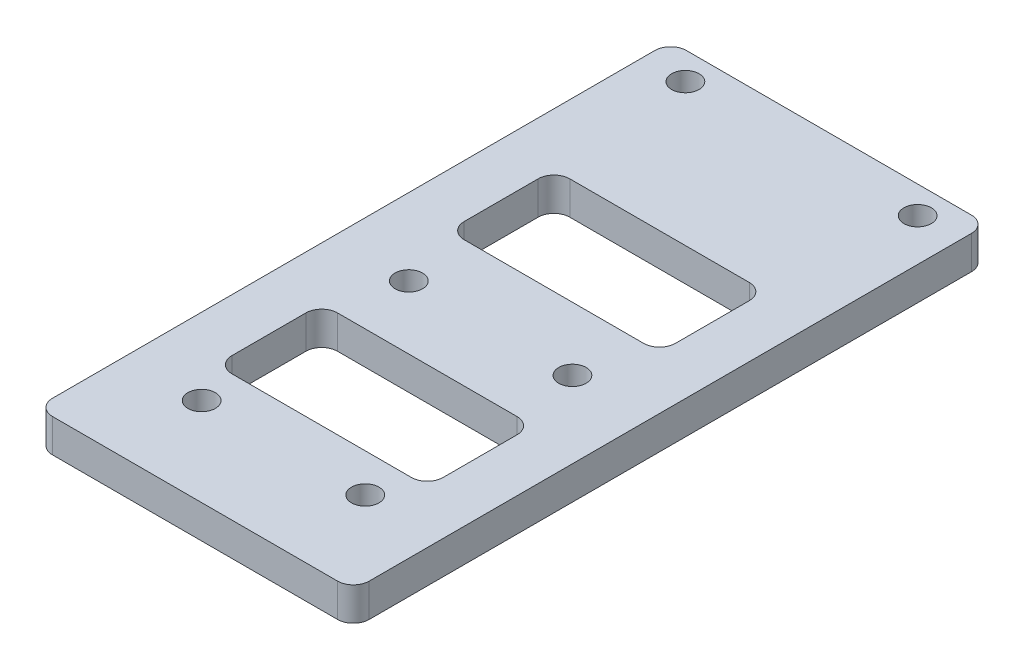
ISO-10303-21;
HEADER;
FILE_DESCRIPTION(('STEP AP214'),'2;1');
FILE_NAME('part.step','',(''),(''),'','','');
FILE_SCHEMA(('AUTOMOTIVE_DESIGN { 1 0 10303 214 1 1 1 1 }'));
ENDSEC;
DATA;
#1=APPLICATION_CONTEXT('core data for automotive mechanical design processes');
#2=APPLICATION_PROTOCOL_DEFINITION('international standard','automotive_design',2000,#1);
#3=PRODUCT_CONTEXT('',#1,'mechanical');
#4=PRODUCT('Part','Part','',(#3));
#5=PRODUCT_RELATED_PRODUCT_CATEGORY('part','',(#4));
#6=PRODUCT_DEFINITION_FORMATION('','',#4);
#7=PRODUCT_DEFINITION_CONTEXT('part definition',#1,'design');
#8=PRODUCT_DEFINITION('design','',#6,#7);
#9=PRODUCT_DEFINITION_SHAPE('','',#8);
#10=(LENGTH_UNIT() NAMED_UNIT(*) SI_UNIT(.MILLI.,.METRE.));
#11=(NAMED_UNIT(*) PLANE_ANGLE_UNIT() SI_UNIT($,.RADIAN.));
#12=(NAMED_UNIT(*) SI_UNIT($,.STERADIAN.) SOLID_ANGLE_UNIT());
#13=UNCERTAINTY_MEASURE_WITH_UNIT(LENGTH_MEASURE(1.E-05),#10,'distance_accuracy_value','');
#14=(GEOMETRIC_REPRESENTATION_CONTEXT(3) GLOBAL_UNCERTAINTY_ASSIGNED_CONTEXT((#13)) GLOBAL_UNIT_ASSIGNED_CONTEXT((#10,
#11,#12)) REPRESENTATION_CONTEXT('',''));
#15=CARTESIAN_POINT('',(0.,0.,0.));
#16=DIRECTION('',(0.,0.,1.));
#17=DIRECTION('',(1.,0.,0.));
#18=AXIS2_PLACEMENT_3D('',#15,#16,#17);
#19=CARTESIAN_POINT('',(-15.,-3.15,-30.025));
#20=DIRECTION('',(-1.,0.,0.));
#21=DIRECTION('',(0.,0.,1.));
#22=AXIS2_PLACEMENT_3D('',#19,#20,#21);
#23=PLANE('',#22);
#24=DIRECTION('',(0.,0.,1.));
#25=VECTOR('',#24,1.);
#26=CARTESIAN_POINT('',(-15.,-3.15,-30.025));
#27=LINE('',#26,#25);
#28=CARTESIAN_POINT('',(-15.,-3.15,-28.525));
#29=VERTEX_POINT('',#28);
#30=CARTESIAN_POINT('',(-15.,-3.15,28.525));
#31=VERTEX_POINT('',#30);
#32=EDGE_CURVE('E343',#29,#31,#27,.T.);
#33=ORIENTED_EDGE('',*,*,#32,.T.);
#34=DIRECTION('',(0.,1.,0.));
#35=VECTOR('',#34,1.);
#36=CARTESIAN_POINT('',(-15.,-3.15,28.525));
#37=LINE('',#36,#35);
#38=CARTESIAN_POINT('',(-15.,0.,28.525));
#39=VERTEX_POINT('',#38);
#40=EDGE_CURVE('E392',#31,#39,#37,.T.);
#41=ORIENTED_EDGE('',*,*,#40,.T.);
#42=DIRECTION('',(0.,0.,1.));
#43=VECTOR('',#42,1.);
#44=CARTESIAN_POINT('',(-15.,0.,-30.025));
#45=LINE('',#44,#43);
#46=CARTESIAN_POINT('',(-15.,0.,-28.525));
#47=VERTEX_POINT('',#46);
#48=EDGE_CURVE('E267',#47,#39,#45,.T.);
#49=ORIENTED_EDGE('',*,*,#48,.F.);
#50=DIRECTION('',(0.,1.,0.));
#51=VECTOR('',#50,1.);
#52=CARTESIAN_POINT('',(-15.,-3.15,-28.525));
#53=LINE('',#52,#51);
#54=EDGE_CURVE('E390',#47,#29,#53,.F.);
#55=ORIENTED_EDGE('',*,*,#54,.T.);
#56=EDGE_LOOP('',(#33,#41,#49,#55));
#57=FACE_BOUND('',#56,.T.);
#58=ADVANCED_FACE('F38',(#57),#23,.T.);
#59=CARTESIAN_POINT('',(-15.,-3.15,-30.025));
#60=DIRECTION('',(0.,0.,-1.));
#61=DIRECTION('',(-1.,0.,0.));
#62=AXIS2_PLACEMENT_3D('',#59,#60,#61);
#63=PLANE('',#62);
#64=DIRECTION('',(-1.,0.,0.));
#65=VECTOR('',#64,1.);
#66=CARTESIAN_POINT('',(-15.,0.,-30.025));
#67=LINE('',#66,#65);
#68=CARTESIAN_POINT('',(13.5,0.,-30.025));
#69=VERTEX_POINT('',#68);
#70=CARTESIAN_POINT('',(-13.5,0.,-30.025));
#71=VERTEX_POINT('',#70);
#72=EDGE_CURVE('E347',#69,#71,#67,.T.);
#73=ORIENTED_EDGE('',*,*,#72,.F.);
#74=DIRECTION('',(0.,1.,0.));
#75=VECTOR('',#74,1.);
#76=CARTESIAN_POINT('',(13.5,-3.15,-30.025));
#77=LINE('',#76,#75);
#78=CARTESIAN_POINT('',(13.5,-3.15,-30.025));
#79=VERTEX_POINT('',#78);
#80=EDGE_CURVE('E11',#69,#79,#77,.F.);
#81=ORIENTED_EDGE('',*,*,#80,.T.);
#82=DIRECTION('',(-1.,0.,0.));
#83=VECTOR('',#82,1.);
#84=CARTESIAN_POINT('',(-15.,-3.15,-30.025));
#85=LINE('',#84,#83);
#86=CARTESIAN_POINT('',(-13.5,-3.15,-30.025));
#87=VERTEX_POINT('',#86);
#88=EDGE_CURVE('E353',#79,#87,#85,.T.);
#89=ORIENTED_EDGE('',*,*,#88,.T.);
#90=DIRECTION('',(0.,1.,0.));
#91=VECTOR('',#90,1.);
#92=CARTESIAN_POINT('',(-13.5,-3.15,-30.025));
#93=LINE('',#92,#91);
#94=EDGE_CURVE('E46',#87,#71,#93,.T.);
#95=ORIENTED_EDGE('',*,*,#94,.T.);
#96=EDGE_LOOP('',(#73,#81,#89,#95));
#97=FACE_BOUND('',#96,.T.);
#98=ADVANCED_FACE('F396',(#97),#63,.T.);
#99=CARTESIAN_POINT('',(15.,-3.15,-30.025));
#100=DIRECTION('',(1.,0.,0.));
#101=DIRECTION('',(0.,0.,-1.));
#102=AXIS2_PLACEMENT_3D('',#99,#100,#101);
#103=PLANE('',#102);
#104=DIRECTION('',(0.,0.,-1.));
#105=VECTOR('',#104,1.);
#106=CARTESIAN_POINT('',(15.,0.,-30.025));
#107=LINE('',#106,#105);
#108=CARTESIAN_POINT('',(15.,0.,28.525));
#109=VERTEX_POINT('',#108);
#110=CARTESIAN_POINT('',(15.,0.,-28.525));
#111=VERTEX_POINT('',#110);
#112=EDGE_CURVE('E361',#109,#111,#107,.T.);
#113=ORIENTED_EDGE('',*,*,#112,.F.);
#114=DIRECTION('',(0.,1.,0.));
#115=VECTOR('',#114,1.);
#116=CARTESIAN_POINT('',(15.,-3.15,28.525));
#117=LINE('',#116,#115);
#118=CARTESIAN_POINT('',(15.,-3.15,28.525));
#119=VERTEX_POINT('',#118);
#120=EDGE_CURVE('E381',#109,#119,#117,.F.);
#121=ORIENTED_EDGE('',*,*,#120,.T.);
#122=DIRECTION('',(0.,0.,-1.));
#123=VECTOR('',#122,1.);
#124=CARTESIAN_POINT('',(15.,-3.15,-30.025));
#125=LINE('',#124,#123);
#126=CARTESIAN_POINT('',(15.,-3.15,-28.525));
#127=VERTEX_POINT('',#126);
#128=EDGE_CURVE('E350',#119,#127,#125,.T.);
#129=ORIENTED_EDGE('',*,*,#128,.T.);
#130=DIRECTION('',(0.,1.,0.));
#131=VECTOR('',#130,1.);
#132=CARTESIAN_POINT('',(15.,-3.15,-28.525));
#133=LINE('',#132,#131);
#134=EDGE_CURVE('E378',#127,#111,#133,.T.);
#135=ORIENTED_EDGE('',*,*,#134,.T.);
#136=EDGE_LOOP('',(#113,#121,#129,#135));
#137=FACE_BOUND('',#136,.T.);
#138=ADVANCED_FACE('F407',(#137),#103,.T.);
#139=CARTESIAN_POINT('',(-15.,-3.15,30.025));
#140=DIRECTION('',(0.,0.,1.));
#141=DIRECTION('',(1.,0.,0.));
#142=AXIS2_PLACEMENT_3D('',#139,#140,#141);
#143=PLANE('',#142);
#144=DIRECTION('',(1.,0.,0.));
#145=VECTOR('',#144,1.);
#146=CARTESIAN_POINT('',(-15.,-3.15,30.025));
#147=LINE('',#146,#145);
#148=CARTESIAN_POINT('',(-13.5,-3.15,30.025));
#149=VERTEX_POINT('',#148);
#150=CARTESIAN_POINT('',(13.5,-3.15,30.025));
#151=VERTEX_POINT('',#150);
#152=EDGE_CURVE('E346',#149,#151,#147,.T.);
#153=ORIENTED_EDGE('',*,*,#152,.T.);
#154=DIRECTION('',(0.,1.,0.));
#155=VECTOR('',#154,1.);
#156=CARTESIAN_POINT('',(13.5,-3.15,30.025));
#157=LINE('',#156,#155);
#158=CARTESIAN_POINT('',(13.5,0.,30.025));
#159=VERTEX_POINT('',#158);
#160=EDGE_CURVE('E367',#151,#159,#157,.T.);
#161=ORIENTED_EDGE('',*,*,#160,.T.);
#162=DIRECTION('',(1.,0.,0.));
#163=VECTOR('',#162,1.);
#164=CARTESIAN_POINT('',(-15.,0.,30.025));
#165=LINE('',#164,#163);
#166=CARTESIAN_POINT('',(-13.5,0.,30.025));
#167=VERTEX_POINT('',#166);
#168=EDGE_CURVE('E358',#167,#159,#165,.T.);
#169=ORIENTED_EDGE('',*,*,#168,.F.);
#170=DIRECTION('',(0.,1.,0.));
#171=VECTOR('',#170,1.);
#172=CARTESIAN_POINT('',(-13.5,-3.15,30.025));
#173=LINE('',#172,#171);
#174=EDGE_CURVE('E355',#167,#149,#173,.F.);
#175=ORIENTED_EDGE('',*,*,#174,.T.);
#176=EDGE_LOOP('',(#153,#161,#169,#175));
#177=FACE_BOUND('',#176,.T.);
#178=ADVANCED_FACE('F417',(#177),#143,.T.);
#179=CARTESIAN_POINT('',(0.,-3.15,0.));
#180=DIRECTION('',(0.,1.,0.));
#181=DIRECTION('',(0.,0.,1.));
#182=AXIS2_PLACEMENT_3D('',#179,#180,#181);
#183=PLANE('',#182);
#184=CARTESIAN_POINT('',(7.75,-3.15,2.025));
#185=DIRECTION('',(0.,1.,0.));
#186=DIRECTION('',(0.,0.,1.));
#187=AXIS2_PLACEMENT_3D('',#184,#185,#186);
#188=CIRCLE('',#187,1.3);
#189=CARTESIAN_POINT('',(7.75,-3.15,3.325));
#190=VERTEX_POINT('',#189);
#191=EDGE_CURVE('E837',#190,#190,#188,.T.);
#192=ORIENTED_EDGE('',*,*,#191,.T.);
#193=EDGE_LOOP('',(#192));
#194=FACE_BOUND('',#193,.T.);
#195=CARTESIAN_POINT('',(-7.75000000000001,-3.15,21.65));
#196=DIRECTION('',(0.,1.,0.));
#197=DIRECTION('',(0.,0.,1.));
#198=AXIS2_PLACEMENT_3D('',#195,#196,#197);
#199=CIRCLE('',#198,1.3);
#200=CARTESIAN_POINT('',(-7.75000000000001,-3.15,22.95));
#201=VERTEX_POINT('',#200);
#202=EDGE_CURVE('E832',#201,#201,#199,.T.);
#203=ORIENTED_EDGE('',*,*,#202,.T.);
#204=EDGE_LOOP('',(#203));
#205=FACE_BOUND('',#204,.T.);
#206=CARTESIAN_POINT('',(7.74999999999999,-3.15,21.65));
#207=DIRECTION('',(0.,1.,0.));
#208=DIRECTION('',(0.,0.,1.));
#209=AXIS2_PLACEMENT_3D('',#206,#207,#208);
#210=CIRCLE('',#209,1.3);
#211=CARTESIAN_POINT('',(7.74999999999999,-3.15,22.95));
#212=VERTEX_POINT('',#211);
#213=EDGE_CURVE('E903',#212,#212,#210,.T.);
#214=ORIENTED_EDGE('',*,*,#213,.T.);
#215=EDGE_LOOP('',(#214));
#216=FACE_BOUND('',#215,.T.);
#217=CARTESIAN_POINT('',(-7.75,-3.15,2.025));
#218=DIRECTION('',(0.,1.,0.));
#219=DIRECTION('',(0.,0.,1.));
#220=AXIS2_PLACEMENT_3D('',#217,#218,#219);
#221=CIRCLE('',#220,1.3);
#222=CARTESIAN_POINT('',(-7.75,-3.15,3.325));
#223=VERTEX_POINT('',#222);
#224=EDGE_CURVE('E846',#223,#223,#221,.T.);
#225=ORIENTED_EDGE('',*,*,#224,.T.);
#226=EDGE_LOOP('',(#225));
#227=FACE_BOUND('',#226,.T.);
#228=CARTESIAN_POINT('',(-11.,-3.15,-27.425));
#229=DIRECTION('',(0.,1.,0.));
#230=DIRECTION('',(0.,0.,1.));
#231=AXIS2_PLACEMENT_3D('',#228,#229,#230);
#232=CIRCLE('',#231,1.3);
#233=CARTESIAN_POINT('',(-11.,-3.15,-26.125));
#234=VERTEX_POINT('',#233);
#235=EDGE_CURVE('E297',#234,#234,#232,.T.);
#236=ORIENTED_EDGE('',*,*,#235,.T.);
#237=EDGE_LOOP('',(#236));
#238=FACE_BOUND('',#237,.T.);
#239=CARTESIAN_POINT('',(11.,-3.15,-27.425));
#240=DIRECTION('',(0.,1.,0.));
#241=DIRECTION('',(0.,0.,1.));
#242=AXIS2_PLACEMENT_3D('',#239,#240,#241);
#243=CIRCLE('',#242,1.3);
#244=CARTESIAN_POINT('',(11.,-3.15,-26.125));
#245=VERTEX_POINT('',#244);
#246=EDGE_CURVE('E231',#245,#245,#243,.T.);
#247=ORIENTED_EDGE('',*,*,#246,.T.);
#248=EDGE_LOOP('',(#247));
#249=FACE_BOUND('',#248,.T.);
#250=DIRECTION('',(0.,0.,1.));
#251=VECTOR('',#250,1.);
#252=CARTESIAN_POINT('',(-10.,-3.15,-12.475));
#253=LINE('',#252,#251);
#254=CARTESIAN_POINT('',(-10.,-3.15,-12.475));
#255=VERTEX_POINT('',#254);
#256=CARTESIAN_POINT('',(-10.,-3.15,-5.475));
#257=VERTEX_POINT('',#256);
#258=EDGE_CURVE('E211',#255,#257,#253,.T.);
#259=ORIENTED_EDGE('',*,*,#258,.T.);
#260=CARTESIAN_POINT('',(-8.5,-3.15,-5.475));
#261=DIRECTION('',(0.,1.,0.));
#262=DIRECTION('',(0.,0.,1.));
#263=AXIS2_PLACEMENT_3D('',#260,#261,#262);
#264=CIRCLE('',#263,1.5);
#265=CARTESIAN_POINT('',(-8.5,-3.15,-3.975));
#266=VERTEX_POINT('',#265);
#267=EDGE_CURVE('E203',#257,#266,#264,.T.);
#268=ORIENTED_EDGE('',*,*,#267,.T.);
#269=DIRECTION('',(1.,0.,0.));
#270=VECTOR('',#269,1.);
#271=CARTESIAN_POINT('',(-8.5,-3.15,-3.975));
#272=LINE('',#271,#270);
#273=CARTESIAN_POINT('',(8.5,-3.15,-3.975));
#274=VERTEX_POINT('',#273);
#275=EDGE_CURVE('E215',#266,#274,#272,.T.);
#276=ORIENTED_EDGE('',*,*,#275,.T.);
#277=CARTESIAN_POINT('',(8.5,-3.15,-5.475));
#278=DIRECTION('',(0.,1.,0.));
#279=DIRECTION('',(0.,0.,1.));
#280=AXIS2_PLACEMENT_3D('',#277,#278,#279);
#281=CIRCLE('',#280,1.5);
#282=CARTESIAN_POINT('',(10.,-3.15,-5.475));
#283=VERTEX_POINT('',#282);
#284=EDGE_CURVE('E219',#274,#283,#281,.T.);
#285=ORIENTED_EDGE('',*,*,#284,.T.);
#286=DIRECTION('',(0.,0.,-1.));
#287=VECTOR('',#286,1.);
#288=CARTESIAN_POINT('',(10.,-3.15,-12.475));
#289=LINE('',#288,#287);
#290=CARTESIAN_POINT('',(10.,-3.15,-12.475));
#291=VERTEX_POINT('',#290);
#292=EDGE_CURVE('E235',#283,#291,#289,.T.);
#293=ORIENTED_EDGE('',*,*,#292,.T.);
#294=CARTESIAN_POINT('',(8.5,-3.15,-12.475));
#295=DIRECTION('',(0.,1.,0.));
#296=DIRECTION('',(0.,0.,-1.));
#297=AXIS2_PLACEMENT_3D('',#294,#295,#296);
#298=CIRCLE('',#297,1.5);
#299=CARTESIAN_POINT('',(8.5,-3.15,-13.975));
#300=VERTEX_POINT('',#299);
#301=EDGE_CURVE('E238',#291,#300,#298,.T.);
#302=ORIENTED_EDGE('',*,*,#301,.T.);
#303=DIRECTION('',(-1.,0.,0.));
#304=VECTOR('',#303,1.);
#305=CARTESIAN_POINT('',(-8.5,-3.15,-13.975));
#306=LINE('',#305,#304);
#307=CARTESIAN_POINT('',(-8.5,-3.15,-13.975));
#308=VERTEX_POINT('',#307);
#309=EDGE_CURVE('E241',#300,#308,#306,.T.);
#310=ORIENTED_EDGE('',*,*,#309,.T.);
#311=CARTESIAN_POINT('',(-8.5,-3.15,-12.475));
#312=DIRECTION('',(0.,1.,0.));
#313=DIRECTION('',(0.,0.,1.));
#314=AXIS2_PLACEMENT_3D('',#311,#312,#313);
#315=CIRCLE('',#314,1.5);
#316=EDGE_CURVE('E244',#308,#255,#315,.T.);
#317=ORIENTED_EDGE('',*,*,#316,.T.);
#318=EDGE_LOOP('',(#259,#268,#276,#285,#293,#302,#310,#317));
#319=FACE_BOUND('',#318,.T.);
#320=DIRECTION('',(0.,0.,1.));
#321=VECTOR('',#320,1.);
#322=CARTESIAN_POINT('',(-10.,-3.15,9.52500000000001));
#323=LINE('',#322,#321);
#324=CARTESIAN_POINT('',(-10.,-3.15,9.52500000000001));
#325=VERTEX_POINT('',#324);
#326=CARTESIAN_POINT('',(-10.,-3.15,16.525));
#327=VERTEX_POINT('',#326);
#328=EDGE_CURVE('E282',#325,#327,#323,.T.);
#329=ORIENTED_EDGE('',*,*,#328,.T.);
#330=CARTESIAN_POINT('',(-8.5,-3.15,16.525));
#331=DIRECTION('',(0.,1.,0.));
#332=DIRECTION('',(0.,0.,1.));
#333=AXIS2_PLACEMENT_3D('',#330,#331,#332);
#334=CIRCLE('',#333,1.5);
#335=CARTESIAN_POINT('',(-8.49999999999999,-3.15,18.025));
#336=VERTEX_POINT('',#335);
#337=EDGE_CURVE('E302',#327,#336,#334,.T.);
#338=ORIENTED_EDGE('',*,*,#337,.T.);
#339=DIRECTION('',(1.,0.,0.));
#340=VECTOR('',#339,1.);
#341=CARTESIAN_POINT('',(-8.49999999999999,-3.15,18.025));
#342=LINE('',#341,#340);
#343=CARTESIAN_POINT('',(8.49999999999999,-3.15,18.025));
#344=VERTEX_POINT('',#343);
#345=EDGE_CURVE('E338',#336,#344,#342,.T.);
#346=ORIENTED_EDGE('',*,*,#345,.T.);
#347=CARTESIAN_POINT('',(8.5,-3.15,16.525));
#348=DIRECTION('',(0.,1.,0.));
#349=DIRECTION('',(0.,0.,1.));
#350=AXIS2_PLACEMENT_3D('',#347,#348,#349);
#351=CIRCLE('',#350,1.5);
#352=CARTESIAN_POINT('',(10.,-3.15,16.525));
#353=VERTEX_POINT('',#352);
#354=EDGE_CURVE('E335',#344,#353,#351,.T.);
#355=ORIENTED_EDGE('',*,*,#354,.T.);
#356=DIRECTION('',(0.,0.,-1.));
#357=VECTOR('',#356,1.);
#358=CARTESIAN_POINT('',(10.,-3.15,9.52500000000001));
#359=LINE('',#358,#357);
#360=CARTESIAN_POINT('',(10.,-3.15,9.52500000000001));
#361=VERTEX_POINT('',#360);
#362=EDGE_CURVE('E332',#353,#361,#359,.T.);
#363=ORIENTED_EDGE('',*,*,#362,.T.);
#364=CARTESIAN_POINT('',(8.5,-3.15,9.525));
#365=DIRECTION('',(0.,1.,0.));
#366=DIRECTION('',(0.,0.,-1.));
#367=AXIS2_PLACEMENT_3D('',#364,#365,#366);
#368=CIRCLE('',#367,1.5);
#369=CARTESIAN_POINT('',(8.49999999999999,-3.15,8.025));
#370=VERTEX_POINT('',#369);
#371=EDGE_CURVE('E329',#361,#370,#368,.T.);
#372=ORIENTED_EDGE('',*,*,#371,.T.);
#373=DIRECTION('',(-1.,0.,0.));
#374=VECTOR('',#373,1.);
#375=CARTESIAN_POINT('',(-8.49999999999999,-3.15,8.025));
#376=LINE('',#375,#374);
#377=CARTESIAN_POINT('',(-8.49999999999999,-3.15,8.025));
#378=VERTEX_POINT('',#377);
#379=EDGE_CURVE('E326',#370,#378,#376,.T.);
#380=ORIENTED_EDGE('',*,*,#379,.T.);
#381=CARTESIAN_POINT('',(-8.5,-3.15,9.525));
#382=DIRECTION('',(0.,1.,0.));
#383=DIRECTION('',(0.,0.,1.));
#384=AXIS2_PLACEMENT_3D('',#381,#382,#383);
#385=CIRCLE('',#384,1.5);
#386=EDGE_CURVE('E323',#378,#325,#385,.T.);
#387=ORIENTED_EDGE('',*,*,#386,.T.);
#388=EDGE_LOOP('',(#329,#338,#346,#355,#363,#372,#380,#387));
#389=FACE_BOUND('',#388,.T.);
#390=ORIENTED_EDGE('',*,*,#128,.F.);
#391=CARTESIAN_POINT('',(13.5,-3.15,28.525));
#392=DIRECTION('',(0.,1.,0.));
#393=DIRECTION('',(0.,0.,1.));
#394=AXIS2_PLACEMENT_3D('',#391,#392,#393);
#395=CIRCLE('',#394,1.5);
#396=EDGE_CURVE('E388',#119,#151,#395,.F.);
#397=ORIENTED_EDGE('',*,*,#396,.T.);
#398=ORIENTED_EDGE('',*,*,#152,.F.);
#399=CARTESIAN_POINT('',(-13.5,-3.15,28.525));
#400=DIRECTION('',(0.,1.,0.));
#401=DIRECTION('',(0.,0.,1.));
#402=AXIS2_PLACEMENT_3D('',#399,#400,#401);
#403=CIRCLE('',#402,1.5);
#404=EDGE_CURVE('E386',#149,#31,#403,.F.);
#405=ORIENTED_EDGE('',*,*,#404,.T.);
#406=ORIENTED_EDGE('',*,*,#32,.F.);
#407=CARTESIAN_POINT('',(-13.5,-3.15,-28.525));
#408=DIRECTION('',(0.,1.,0.));
#409=DIRECTION('',(0.,0.,1.));
#410=AXIS2_PLACEMENT_3D('',#407,#408,#409);
#411=CIRCLE('',#410,1.5);
#412=EDGE_CURVE('E53',#29,#87,#411,.F.);
#413=ORIENTED_EDGE('',*,*,#412,.T.);
#414=ORIENTED_EDGE('',*,*,#88,.F.);
#415=CARTESIAN_POINT('',(13.5,-3.15,-28.525));
#416=DIRECTION('',(0.,1.,0.));
#417=DIRECTION('',(0.,0.,1.));
#418=AXIS2_PLACEMENT_3D('',#415,#416,#417);
#419=CIRCLE('',#418,1.5);
#420=EDGE_CURVE('E384',#79,#127,#419,.F.);
#421=ORIENTED_EDGE('',*,*,#420,.T.);
#422=EDGE_LOOP('',(#390,#397,#398,#405,#406,#413,#414,#421));
#423=FACE_BOUND('',#422,.T.);
#424=ADVANCED_FACE('F221',(#194,#205,#216,#227,#238,#249,#319,#389,#423),#183,.F.);
#425=CARTESIAN_POINT('',(0.,0.,0.));
#426=DIRECTION('',(0.,1.,0.));
#427=DIRECTION('',(0.,0.,1.));
#428=AXIS2_PLACEMENT_3D('',#425,#426,#427);
#429=PLANE('',#428);
#430=CARTESIAN_POINT('',(7.75,0.,2.025));
#431=DIRECTION('',(0.,1.,0.));
#432=DIRECTION('',(0.,0.,1.));
#433=AXIS2_PLACEMENT_3D('',#430,#431,#432);
#434=CIRCLE('',#433,1.3);
#435=CARTESIAN_POINT('',(7.75,0.,3.325));
#436=VERTEX_POINT('',#435);
#437=EDGE_CURVE('E840',#436,#436,#434,.T.);
#438=ORIENTED_EDGE('',*,*,#437,.F.);
#439=EDGE_LOOP('',(#438));
#440=FACE_BOUND('',#439,.T.);
#441=CARTESIAN_POINT('',(-7.75000000000001,0.,21.65));
#442=DIRECTION('',(0.,1.,0.));
#443=DIRECTION('',(0.,0.,1.));
#444=AXIS2_PLACEMENT_3D('',#441,#442,#443);
#445=CIRCLE('',#444,1.3);
#446=CARTESIAN_POINT('',(-7.75000000000001,0.,22.95));
#447=VERTEX_POINT('',#446);
#448=EDGE_CURVE('E835',#447,#447,#445,.T.);
#449=ORIENTED_EDGE('',*,*,#448,.F.);
#450=EDGE_LOOP('',(#449));
#451=FACE_BOUND('',#450,.T.);
#452=CARTESIAN_POINT('',(7.74999999999999,0.,21.65));
#453=DIRECTION('',(0.,1.,0.));
#454=DIRECTION('',(0.,0.,1.));
#455=AXIS2_PLACEMENT_3D('',#452,#453,#454);
#456=CIRCLE('',#455,1.3);
#457=CARTESIAN_POINT('',(7.74999999999999,0.,22.95));
#458=VERTEX_POINT('',#457);
#459=EDGE_CURVE('E842',#458,#458,#456,.T.);
#460=ORIENTED_EDGE('',*,*,#459,.F.);
#461=EDGE_LOOP('',(#460));
#462=FACE_BOUND('',#461,.T.);
#463=CARTESIAN_POINT('',(-7.75,0.,2.025));
#464=DIRECTION('',(0.,1.,0.));
#465=DIRECTION('',(0.,0.,1.));
#466=AXIS2_PLACEMENT_3D('',#463,#464,#465);
#467=CIRCLE('',#466,1.3);
#468=CARTESIAN_POINT('',(-7.75,0.,3.325));
#469=VERTEX_POINT('',#468);
#470=EDGE_CURVE('E849',#469,#469,#467,.T.);
#471=ORIENTED_EDGE('',*,*,#470,.F.);
#472=EDGE_LOOP('',(#471));
#473=FACE_BOUND('',#472,.T.);
#474=CARTESIAN_POINT('',(-11.,0.,-27.425));
#475=DIRECTION('',(0.,1.,0.));
#476=DIRECTION('',(0.,0.,1.));
#477=AXIS2_PLACEMENT_3D('',#474,#475,#476);
#478=CIRCLE('',#477,1.3);
#479=CARTESIAN_POINT('',(-11.,0.,-26.125));
#480=VERTEX_POINT('',#479);
#481=EDGE_CURVE('E854',#480,#480,#478,.T.);
#482=ORIENTED_EDGE('',*,*,#481,.F.);
#483=EDGE_LOOP('',(#482));
#484=FACE_BOUND('',#483,.T.);
#485=CARTESIAN_POINT('',(11.,0.,-27.425));
#486=DIRECTION('',(0.,1.,0.));
#487=DIRECTION('',(0.,0.,1.));
#488=AXIS2_PLACEMENT_3D('',#485,#486,#487);
#489=CIRCLE('',#488,1.3);
#490=CARTESIAN_POINT('',(11.,0.,-26.125));
#491=VERTEX_POINT('',#490);
#492=EDGE_CURVE('E856',#491,#491,#489,.T.);
#493=ORIENTED_EDGE('',*,*,#492,.F.);
#494=EDGE_LOOP('',(#493));
#495=FACE_BOUND('',#494,.T.);
#496=CARTESIAN_POINT('',(-8.5,0.,-5.475));
#497=DIRECTION('',(0.,1.,0.));
#498=DIRECTION('',(0.,0.,1.));
#499=AXIS2_PLACEMENT_3D('',#496,#497,#498);
#500=CIRCLE('',#499,1.5);
#501=CARTESIAN_POINT('',(-10.,0.,-5.475));
#502=VERTEX_POINT('',#501);
#503=CARTESIAN_POINT('',(-8.5,0.,-3.975));
#504=VERTEX_POINT('',#503);
#505=EDGE_CURVE('E206',#502,#504,#500,.T.);
#506=ORIENTED_EDGE('',*,*,#505,.F.);
#507=DIRECTION('',(0.,0.,1.));
#508=VECTOR('',#507,1.);
#509=CARTESIAN_POINT('',(-10.,0.,-12.475));
#510=LINE('',#509,#508);
#511=CARTESIAN_POINT('',(-10.,0.,-12.475));
#512=VERTEX_POINT('',#511);
#513=EDGE_CURVE('E225',#512,#502,#510,.T.);
#514=ORIENTED_EDGE('',*,*,#513,.F.);
#515=CARTESIAN_POINT('',(-8.5,0.,-12.475));
#516=DIRECTION('',(0.,1.,0.));
#517=DIRECTION('',(0.,0.,1.));
#518=AXIS2_PLACEMENT_3D('',#515,#516,#517);
#519=CIRCLE('',#518,1.5);
#520=CARTESIAN_POINT('',(-8.5,0.,-13.975));
#521=VERTEX_POINT('',#520);
#522=EDGE_CURVE('E228',#521,#512,#519,.T.);
#523=ORIENTED_EDGE('',*,*,#522,.F.);
#524=DIRECTION('',(-1.,0.,0.));
#525=VECTOR('',#524,1.);
#526=CARTESIAN_POINT('',(-8.5,0.,-13.975));
#527=LINE('',#526,#525);
#528=CARTESIAN_POINT('',(8.5,0.,-13.975));
#529=VERTEX_POINT('',#528);
#530=EDGE_CURVE('E260',#529,#521,#527,.T.);
#531=ORIENTED_EDGE('',*,*,#530,.F.);
#532=CARTESIAN_POINT('',(8.5,0.,-12.475));
#533=DIRECTION('',(0.,1.,0.));
#534=DIRECTION('',(0.,0.,-1.));
#535=AXIS2_PLACEMENT_3D('',#532,#533,#534);
#536=CIRCLE('',#535,1.5);
#537=CARTESIAN_POINT('',(10.,0.,-12.475));
#538=VERTEX_POINT('',#537);
#539=EDGE_CURVE('E257',#538,#529,#536,.T.);
#540=ORIENTED_EDGE('',*,*,#539,.F.);
#541=DIRECTION('',(0.,0.,-1.));
#542=VECTOR('',#541,1.);
#543=CARTESIAN_POINT('',(10.,0.,-12.475));
#544=LINE('',#543,#542);
#545=CARTESIAN_POINT('',(10.,0.,-5.475));
#546=VERTEX_POINT('',#545);
#547=EDGE_CURVE('E254',#546,#538,#544,.T.);
#548=ORIENTED_EDGE('',*,*,#547,.F.);
#549=CARTESIAN_POINT('',(8.5,0.,-5.475));
#550=DIRECTION('',(0.,1.,0.));
#551=DIRECTION('',(0.,0.,1.));
#552=AXIS2_PLACEMENT_3D('',#549,#550,#551);
#553=CIRCLE('',#552,1.5);
#554=CARTESIAN_POINT('',(8.5,0.,-3.975));
#555=VERTEX_POINT('',#554);
#556=EDGE_CURVE('E251',#555,#546,#553,.T.);
#557=ORIENTED_EDGE('',*,*,#556,.F.);
#558=DIRECTION('',(1.,0.,0.));
#559=VECTOR('',#558,1.);
#560=CARTESIAN_POINT('',(-8.5,0.,-3.975));
#561=LINE('',#560,#559);
#562=EDGE_CURVE('E248',#504,#555,#561,.T.);
#563=ORIENTED_EDGE('',*,*,#562,.F.);
#564=EDGE_LOOP('',(#506,#514,#523,#531,#540,#548,#557,#563));
#565=FACE_BOUND('',#564,.T.);
#566=CARTESIAN_POINT('',(-8.5,0.,16.525));
#567=DIRECTION('',(0.,1.,0.));
#568=DIRECTION('',(0.,0.,1.));
#569=AXIS2_PLACEMENT_3D('',#566,#567,#568);
#570=CIRCLE('',#569,1.5);
#571=CARTESIAN_POINT('',(-10.,0.,16.525));
#572=VERTEX_POINT('',#571);
#573=CARTESIAN_POINT('',(-8.49999999999999,0.,18.025));
#574=VERTEX_POINT('',#573);
#575=EDGE_CURVE('E249',#572,#574,#570,.T.);
#576=ORIENTED_EDGE('',*,*,#575,.F.);
#577=DIRECTION('',(0.,0.,1.));
#578=VECTOR('',#577,1.);
#579=CARTESIAN_POINT('',(-10.,0.,9.52500000000001));
#580=LINE('',#579,#578);
#581=CARTESIAN_POINT('',(-10.,0.,9.52500000000001));
#582=VERTEX_POINT('',#581);
#583=EDGE_CURVE('E298',#582,#572,#580,.T.);
#584=ORIENTED_EDGE('',*,*,#583,.F.);
#585=CARTESIAN_POINT('',(-8.5,0.,9.525));
#586=DIRECTION('',(0.,1.,0.));
#587=DIRECTION('',(0.,0.,1.));
#588=AXIS2_PLACEMENT_3D('',#585,#586,#587);
#589=CIRCLE('',#588,1.5);
#590=CARTESIAN_POINT('',(-8.49999999999999,0.,8.025));
#591=VERTEX_POINT('',#590);
#592=EDGE_CURVE('E301',#591,#582,#589,.T.);
#593=ORIENTED_EDGE('',*,*,#592,.F.);
#594=DIRECTION('',(-1.,0.,0.));
#595=VECTOR('',#594,1.);
#596=CARTESIAN_POINT('',(-8.49999999999999,0.,8.025));
#597=LINE('',#596,#595);
#598=CARTESIAN_POINT('',(8.49999999999999,0.,8.025));
#599=VERTEX_POINT('',#598);
#600=EDGE_CURVE('E305',#599,#591,#597,.T.);
#601=ORIENTED_EDGE('',*,*,#600,.F.);
#602=CARTESIAN_POINT('',(8.5,0.,9.525));
#603=DIRECTION('',(0.,1.,0.));
#604=DIRECTION('',(0.,0.,-1.));
#605=AXIS2_PLACEMENT_3D('',#602,#603,#604);
#606=CIRCLE('',#605,1.5);
#607=CARTESIAN_POINT('',(10.,0.,9.52500000000001));
#608=VERTEX_POINT('',#607);
#609=EDGE_CURVE('E308',#608,#599,#606,.T.);
#610=ORIENTED_EDGE('',*,*,#609,.F.);
#611=DIRECTION('',(0.,0.,-1.));
#612=VECTOR('',#611,1.);
#613=CARTESIAN_POINT('',(10.,0.,9.52500000000001));
#614=LINE('',#613,#612);
#615=CARTESIAN_POINT('',(10.,0.,16.525));
#616=VERTEX_POINT('',#615);
#617=EDGE_CURVE('E311',#616,#608,#614,.T.);
#618=ORIENTED_EDGE('',*,*,#617,.F.);
#619=CARTESIAN_POINT('',(8.5,0.,16.525));
#620=DIRECTION('',(0.,1.,0.));
#621=DIRECTION('',(0.,0.,1.));
#622=AXIS2_PLACEMENT_3D('',#619,#620,#621);
#623=CIRCLE('',#622,1.5);
#624=CARTESIAN_POINT('',(8.49999999999999,0.,18.025));
#625=VERTEX_POINT('',#624);
#626=EDGE_CURVE('E314',#625,#616,#623,.T.);
#627=ORIENTED_EDGE('',*,*,#626,.F.);
#628=DIRECTION('',(1.,0.,0.));
#629=VECTOR('',#628,1.);
#630=CARTESIAN_POINT('',(-8.49999999999999,0.,18.025));
#631=LINE('',#630,#629);
#632=EDGE_CURVE('E317',#574,#625,#631,.T.);
#633=ORIENTED_EDGE('',*,*,#632,.F.);
#634=EDGE_LOOP('',(#576,#584,#593,#601,#610,#618,#627,#633));
#635=FACE_BOUND('',#634,.T.);
#636=ORIENTED_EDGE('',*,*,#168,.T.);
#637=CARTESIAN_POINT('',(13.5,0.,28.525));
#638=DIRECTION('',(0.,1.,0.));
#639=DIRECTION('',(0.,0.,1.));
#640=AXIS2_PLACEMENT_3D('',#637,#638,#639);
#641=CIRCLE('',#640,1.5);
#642=EDGE_CURVE('E376',#159,#109,#641,.T.);
#643=ORIENTED_EDGE('',*,*,#642,.T.);
#644=ORIENTED_EDGE('',*,*,#112,.T.);
#645=CARTESIAN_POINT('',(13.5,0.,-28.525));
#646=DIRECTION('',(0.,1.,0.));
#647=DIRECTION('',(0.,0.,1.));
#648=AXIS2_PLACEMENT_3D('',#645,#646,#647);
#649=CIRCLE('',#648,1.5);
#650=EDGE_CURVE('E372',#111,#69,#649,.T.);
#651=ORIENTED_EDGE('',*,*,#650,.T.);
#652=ORIENTED_EDGE('',*,*,#72,.T.);
#653=CARTESIAN_POINT('',(-13.5,0.,-28.525));
#654=DIRECTION('',(0.,1.,0.));
#655=DIRECTION('',(0.,0.,1.));
#656=AXIS2_PLACEMENT_3D('',#653,#654,#655);
#657=CIRCLE('',#656,1.5);
#658=EDGE_CURVE('E370',#71,#47,#657,.T.);
#659=ORIENTED_EDGE('',*,*,#658,.T.);
#660=ORIENTED_EDGE('',*,*,#48,.T.);
#661=CARTESIAN_POINT('',(-13.5,0.,28.525));
#662=DIRECTION('',(0.,1.,0.));
#663=DIRECTION('',(0.,0.,1.));
#664=AXIS2_PLACEMENT_3D('',#661,#662,#663);
#665=CIRCLE('',#664,1.5);
#666=EDGE_CURVE('E374',#39,#167,#665,.T.);
#667=ORIENTED_EDGE('',*,*,#666,.T.);
#668=EDGE_LOOP('',(#636,#643,#644,#651,#652,#659,#660,#667));
#669=FACE_BOUND('',#668,.T.);
#670=ADVANCED_FACE('F399',(#440,#451,#462,#473,#484,#495,#565,#635,#669),#429,.T.);
#671=CARTESIAN_POINT('',(-8.5,-3.15,16.525));
#672=DIRECTION('',(0.,1.,0.));
#673=DIRECTION('',(0.,0.,1.));
#674=AXIS2_PLACEMENT_3D('',#671,#672,#673);
#675=CYLINDRICAL_SURFACE('',#674,1.5);
#676=ORIENTED_EDGE('',*,*,#575,.T.);
#677=DIRECTION('',(0.,1.,0.));
#678=VECTOR('',#677,1.);
#679=CARTESIAN_POINT('',(-8.49999999999999,-3.15,18.025));
#680=LINE('',#679,#678);
#681=EDGE_CURVE('E279',#336,#574,#680,.T.);
#682=ORIENTED_EDGE('',*,*,#681,.F.);
#683=ORIENTED_EDGE('',*,*,#337,.F.);
#684=DIRECTION('',(0.,1.,0.));
#685=VECTOR('',#684,1.);
#686=CARTESIAN_POINT('',(-10.,-3.15,16.525));
#687=LINE('',#686,#685);
#688=EDGE_CURVE('E295',#327,#572,#687,.T.);
#689=ORIENTED_EDGE('',*,*,#688,.T.);
#690=EDGE_LOOP('',(#676,#682,#683,#689));
#691=FACE_BOUND('',#690,.T.);
#692=ADVANCED_FACE('F498',(#691),#675,.F.);
#693=CARTESIAN_POINT('',(-10.,-3.15,9.52500000000001));
#694=DIRECTION('',(-1.,0.,0.));
#695=DIRECTION('',(0.,0.,1.));
#696=AXIS2_PLACEMENT_3D('',#693,#694,#695);
#697=PLANE('',#696);
#698=ORIENTED_EDGE('',*,*,#583,.T.);
#699=ORIENTED_EDGE('',*,*,#688,.F.);
#700=ORIENTED_EDGE('',*,*,#328,.F.);
#701=DIRECTION('',(0.,1.,0.));
#702=VECTOR('',#701,1.);
#703=CARTESIAN_POINT('',(-10.,-3.15,9.52500000000001));
#704=LINE('',#703,#702);
#705=EDGE_CURVE('E293',#325,#582,#704,.T.);
#706=ORIENTED_EDGE('',*,*,#705,.T.);
#707=EDGE_LOOP('',(#698,#699,#700,#706));
#708=FACE_BOUND('',#707,.T.);
#709=ADVANCED_FACE('F508',(#708),#697,.F.);
#710=CARTESIAN_POINT('',(-8.5,-3.15,9.525));
#711=DIRECTION('',(0.,1.,0.));
#712=DIRECTION('',(0.,0.,1.));
#713=AXIS2_PLACEMENT_3D('',#710,#711,#712);
#714=CYLINDRICAL_SURFACE('',#713,1.5);
#715=ORIENTED_EDGE('',*,*,#592,.T.);
#716=ORIENTED_EDGE('',*,*,#705,.F.);
#717=ORIENTED_EDGE('',*,*,#386,.F.);
#718=DIRECTION('',(0.,1.,0.));
#719=VECTOR('',#718,1.);
#720=CARTESIAN_POINT('',(-8.49999999999999,-3.15,8.025));
#721=LINE('',#720,#719);
#722=EDGE_CURVE('E291',#378,#591,#721,.T.);
#723=ORIENTED_EDGE('',*,*,#722,.T.);
#724=EDGE_LOOP('',(#715,#716,#717,#723));
#725=FACE_BOUND('',#724,.T.);
#726=ADVANCED_FACE('F516',(#725),#714,.F.);
#727=CARTESIAN_POINT('',(-8.49999999999999,-3.15,8.025));
#728=DIRECTION('',(0.,0.,-1.));
#729=DIRECTION('',(-1.,0.,0.));
#730=AXIS2_PLACEMENT_3D('',#727,#728,#729);
#731=PLANE('',#730);
#732=ORIENTED_EDGE('',*,*,#600,.T.);
#733=ORIENTED_EDGE('',*,*,#722,.F.);
#734=ORIENTED_EDGE('',*,*,#379,.F.);
#735=DIRECTION('',(0.,1.,0.));
#736=VECTOR('',#735,1.);
#737=CARTESIAN_POINT('',(8.49999999999999,-3.15,8.025));
#738=LINE('',#737,#736);
#739=EDGE_CURVE('E289',#370,#599,#738,.T.);
#740=ORIENTED_EDGE('',*,*,#739,.T.);
#741=EDGE_LOOP('',(#732,#733,#734,#740));
#742=FACE_BOUND('',#741,.T.);
#743=ADVANCED_FACE('F524',(#742),#731,.F.);
#744=CARTESIAN_POINT('',(8.5,-3.15,9.525));
#745=DIRECTION('',(0.,1.,0.));
#746=DIRECTION('',(0.,0.,1.));
#747=AXIS2_PLACEMENT_3D('',#744,#745,#746);
#748=CYLINDRICAL_SURFACE('',#747,1.5);
#749=ORIENTED_EDGE('',*,*,#609,.T.);
#750=ORIENTED_EDGE('',*,*,#739,.F.);
#751=ORIENTED_EDGE('',*,*,#371,.F.);
#752=DIRECTION('',(0.,1.,0.));
#753=VECTOR('',#752,1.);
#754=CARTESIAN_POINT('',(10.,-3.15,9.52500000000001));
#755=LINE('',#754,#753);
#756=EDGE_CURVE('E287',#361,#608,#755,.T.);
#757=ORIENTED_EDGE('',*,*,#756,.T.);
#758=EDGE_LOOP('',(#749,#750,#751,#757));
#759=FACE_BOUND('',#758,.T.);
#760=ADVANCED_FACE('F532',(#759),#748,.F.);
#761=CARTESIAN_POINT('',(10.,-3.15,9.52500000000001));
#762=DIRECTION('',(1.,0.,0.));
#763=DIRECTION('',(0.,0.,-1.));
#764=AXIS2_PLACEMENT_3D('',#761,#762,#763);
#765=PLANE('',#764);
#766=ORIENTED_EDGE('',*,*,#617,.T.);
#767=ORIENTED_EDGE('',*,*,#756,.F.);
#768=ORIENTED_EDGE('',*,*,#362,.F.);
#769=DIRECTION('',(0.,1.,0.));
#770=VECTOR('',#769,1.);
#771=CARTESIAN_POINT('',(10.,-3.15,16.525));
#772=LINE('',#771,#770);
#773=EDGE_CURVE('E285',#353,#616,#772,.T.);
#774=ORIENTED_EDGE('',*,*,#773,.T.);
#775=EDGE_LOOP('',(#766,#767,#768,#774));
#776=FACE_BOUND('',#775,.T.);
#777=ADVANCED_FACE('F540',(#776),#765,.F.);
#778=CARTESIAN_POINT('',(8.5,-3.15,16.525));
#779=DIRECTION('',(0.,1.,0.));
#780=DIRECTION('',(0.,0.,1.));
#781=AXIS2_PLACEMENT_3D('',#778,#779,#780);
#782=CYLINDRICAL_SURFACE('',#781,1.5);
#783=ORIENTED_EDGE('',*,*,#626,.T.);
#784=ORIENTED_EDGE('',*,*,#773,.F.);
#785=ORIENTED_EDGE('',*,*,#354,.F.);
#786=DIRECTION('',(0.,1.,0.));
#787=VECTOR('',#786,1.);
#788=CARTESIAN_POINT('',(8.49999999999999,-3.15,18.025));
#789=LINE('',#788,#787);
#790=EDGE_CURVE('E283',#344,#625,#789,.T.);
#791=ORIENTED_EDGE('',*,*,#790,.T.);
#792=EDGE_LOOP('',(#783,#784,#785,#791));
#793=FACE_BOUND('',#792,.T.);
#794=ADVANCED_FACE('F548',(#793),#782,.F.);
#795=CARTESIAN_POINT('',(-8.49999999999999,-3.15,18.025));
#796=DIRECTION('',(0.,0.,1.));
#797=DIRECTION('',(1.,0.,0.));
#798=AXIS2_PLACEMENT_3D('',#795,#796,#797);
#799=PLANE('',#798);
#800=ORIENTED_EDGE('',*,*,#632,.T.);
#801=ORIENTED_EDGE('',*,*,#790,.F.);
#802=ORIENTED_EDGE('',*,*,#345,.F.);
#803=ORIENTED_EDGE('',*,*,#681,.T.);
#804=EDGE_LOOP('',(#800,#801,#802,#803));
#805=FACE_BOUND('',#804,.T.);
#806=ADVANCED_FACE('F556',(#805),#799,.F.);
#807=CARTESIAN_POINT('',(-8.5,-3.15,-5.475));
#808=DIRECTION('',(0.,1.,0.));
#809=DIRECTION('',(0.,0.,1.));
#810=AXIS2_PLACEMENT_3D('',#807,#808,#809);
#811=CYLINDRICAL_SURFACE('',#810,1.5);
#812=ORIENTED_EDGE('',*,*,#505,.T.);
#813=DIRECTION('',(0.,1.,0.));
#814=VECTOR('',#813,1.);
#815=CARTESIAN_POINT('',(-8.5,-3.15,-3.975));
#816=LINE('',#815,#814);
#817=EDGE_CURVE('E199',#266,#504,#816,.T.);
#818=ORIENTED_EDGE('',*,*,#817,.F.);
#819=ORIENTED_EDGE('',*,*,#267,.F.);
#820=DIRECTION('',(0.,1.,0.));
#821=VECTOR('',#820,1.);
#822=CARTESIAN_POINT('',(-10.,-3.15,-5.475));
#823=LINE('',#822,#821);
#824=EDGE_CURVE('E265',#257,#502,#823,.T.);
#825=ORIENTED_EDGE('',*,*,#824,.T.);
#826=EDGE_LOOP('',(#812,#818,#819,#825));
#827=FACE_BOUND('',#826,.T.);
#828=ADVANCED_FACE('F201',(#827),#811,.F.);
#829=CARTESIAN_POINT('',(-10.,-3.15,-12.475));
#830=DIRECTION('',(-1.,0.,0.));
#831=DIRECTION('',(0.,0.,1.));
#832=AXIS2_PLACEMENT_3D('',#829,#830,#831);
#833=PLANE('',#832);
#834=ORIENTED_EDGE('',*,*,#513,.T.);
#835=ORIENTED_EDGE('',*,*,#824,.F.);
#836=ORIENTED_EDGE('',*,*,#258,.F.);
#837=DIRECTION('',(0.,1.,0.));
#838=VECTOR('',#837,1.);
#839=CARTESIAN_POINT('',(-10.,-3.15,-12.475));
#840=LINE('',#839,#838);
#841=EDGE_CURVE('E268',#255,#512,#840,.T.);
#842=ORIENTED_EDGE('',*,*,#841,.T.);
#843=EDGE_LOOP('',(#834,#835,#836,#842));
#844=FACE_BOUND('',#843,.T.);
#845=ADVANCED_FACE('F572',(#844),#833,.F.);
#846=CARTESIAN_POINT('',(-8.5,-3.15,-12.475));
#847=DIRECTION('',(0.,1.,0.));
#848=DIRECTION('',(0.,0.,1.));
#849=AXIS2_PLACEMENT_3D('',#846,#847,#848);
#850=CYLINDRICAL_SURFACE('',#849,1.5);
#851=ORIENTED_EDGE('',*,*,#522,.T.);
#852=ORIENTED_EDGE('',*,*,#841,.F.);
#853=ORIENTED_EDGE('',*,*,#316,.F.);
#854=DIRECTION('',(0.,1.,0.));
#855=VECTOR('',#854,1.);
#856=CARTESIAN_POINT('',(-8.5,-3.15,-13.975));
#857=LINE('',#856,#855);
#858=EDGE_CURVE('E270',#308,#521,#857,.T.);
#859=ORIENTED_EDGE('',*,*,#858,.T.);
#860=EDGE_LOOP('',(#851,#852,#853,#859));
#861=FACE_BOUND('',#860,.T.);
#862=ADVANCED_FACE('F580',(#861),#850,.F.);
#863=CARTESIAN_POINT('',(-8.5,-3.15,-13.975));
#864=DIRECTION('',(0.,0.,-1.));
#865=DIRECTION('',(-1.,0.,0.));
#866=AXIS2_PLACEMENT_3D('',#863,#864,#865);
#867=PLANE('',#866);
#868=ORIENTED_EDGE('',*,*,#530,.T.);
#869=ORIENTED_EDGE('',*,*,#858,.F.);
#870=ORIENTED_EDGE('',*,*,#309,.F.);
#871=DIRECTION('',(0.,1.,0.));
#872=VECTOR('',#871,1.);
#873=CARTESIAN_POINT('',(8.5,-3.15,-13.975));
#874=LINE('',#873,#872);
#875=EDGE_CURVE('E272',#300,#529,#874,.T.);
#876=ORIENTED_EDGE('',*,*,#875,.T.);
#877=EDGE_LOOP('',(#868,#869,#870,#876));
#878=FACE_BOUND('',#877,.T.);
#879=ADVANCED_FACE('F589',(#878),#867,.F.);
#880=CARTESIAN_POINT('',(8.5,-3.15,-12.475));
#881=DIRECTION('',(0.,1.,0.));
#882=DIRECTION('',(0.,0.,1.));
#883=AXIS2_PLACEMENT_3D('',#880,#881,#882);
#884=CYLINDRICAL_SURFACE('',#883,1.5);
#885=ORIENTED_EDGE('',*,*,#539,.T.);
#886=ORIENTED_EDGE('',*,*,#875,.F.);
#887=ORIENTED_EDGE('',*,*,#301,.F.);
#888=DIRECTION('',(0.,1.,0.));
#889=VECTOR('',#888,1.);
#890=CARTESIAN_POINT('',(10.,-3.15,-12.475));
#891=LINE('',#890,#889);
#892=EDGE_CURVE('E274',#291,#538,#891,.T.);
#893=ORIENTED_EDGE('',*,*,#892,.T.);
#894=EDGE_LOOP('',(#885,#886,#887,#893));
#895=FACE_BOUND('',#894,.T.);
#896=ADVANCED_FACE('F596',(#895),#884,.F.);
#897=CARTESIAN_POINT('',(10.,-3.15,-12.475));
#898=DIRECTION('',(1.,0.,0.));
#899=DIRECTION('',(0.,0.,-1.));
#900=AXIS2_PLACEMENT_3D('',#897,#898,#899);
#901=PLANE('',#900);
#902=ORIENTED_EDGE('',*,*,#547,.T.);
#903=ORIENTED_EDGE('',*,*,#892,.F.);
#904=ORIENTED_EDGE('',*,*,#292,.F.);
#905=DIRECTION('',(0.,1.,0.));
#906=VECTOR('',#905,1.);
#907=CARTESIAN_POINT('',(10.,-3.15,-5.475));
#908=LINE('',#907,#906);
#909=EDGE_CURVE('E276',#283,#546,#908,.T.);
#910=ORIENTED_EDGE('',*,*,#909,.T.);
#911=EDGE_LOOP('',(#902,#903,#904,#910));
#912=FACE_BOUND('',#911,.T.);
#913=ADVANCED_FACE('F604',(#912),#901,.F.);
#914=CARTESIAN_POINT('',(8.5,-3.15,-5.475));
#915=DIRECTION('',(0.,1.,0.));
#916=DIRECTION('',(0.,0.,1.));
#917=AXIS2_PLACEMENT_3D('',#914,#915,#916);
#918=CYLINDRICAL_SURFACE('',#917,1.5);
#919=ORIENTED_EDGE('',*,*,#556,.T.);
#920=ORIENTED_EDGE('',*,*,#909,.F.);
#921=ORIENTED_EDGE('',*,*,#284,.F.);
#922=DIRECTION('',(0.,1.,0.));
#923=VECTOR('',#922,1.);
#924=CARTESIAN_POINT('',(8.5,-3.15,-3.975));
#925=LINE('',#924,#923);
#926=EDGE_CURVE('E210',#274,#555,#925,.T.);
#927=ORIENTED_EDGE('',*,*,#926,.T.);
#928=EDGE_LOOP('',(#919,#920,#921,#927));
#929=FACE_BOUND('',#928,.T.);
#930=ADVANCED_FACE('F613',(#929),#918,.F.);
#931=CARTESIAN_POINT('',(-8.5,-3.15,-3.975));
#932=DIRECTION('',(0.,0.,1.));
#933=DIRECTION('',(1.,0.,0.));
#934=AXIS2_PLACEMENT_3D('',#931,#932,#933);
#935=PLANE('',#934);
#936=ORIENTED_EDGE('',*,*,#562,.T.);
#937=ORIENTED_EDGE('',*,*,#926,.F.);
#938=ORIENTED_EDGE('',*,*,#275,.F.);
#939=ORIENTED_EDGE('',*,*,#817,.T.);
#940=EDGE_LOOP('',(#936,#937,#938,#939));
#941=FACE_BOUND('',#940,.T.);
#942=ADVANCED_FACE('F216',(#941),#935,.F.);
#943=CARTESIAN_POINT('',(11.,-3.15,-27.425));
#944=DIRECTION('',(0.,1.,0.));
#945=DIRECTION('',(0.,0.,1.));
#946=AXIS2_PLACEMENT_3D('',#943,#944,#945);
#947=CYLINDRICAL_SURFACE('',#946,1.3);
#948=ORIENTED_EDGE('',*,*,#246,.F.);
#949=EDGE_LOOP('',(#948));
#950=FACE_BOUND('',#949,.T.);
#951=ORIENTED_EDGE('',*,*,#492,.T.);
#952=EDGE_LOOP('',(#951));
#953=FACE_BOUND('',#952,.T.);
#954=ADVANCED_FACE('F626',(#950,#953),#947,.F.);
#955=CARTESIAN_POINT('',(-11.,-3.15,-27.425));
#956=DIRECTION('',(0.,1.,0.));
#957=DIRECTION('',(0.,0.,1.));
#958=AXIS2_PLACEMENT_3D('',#955,#956,#957);
#959=CYLINDRICAL_SURFACE('',#958,1.3);
#960=ORIENTED_EDGE('',*,*,#235,.F.);
#961=EDGE_LOOP('',(#960));
#962=FACE_BOUND('',#961,.T.);
#963=ORIENTED_EDGE('',*,*,#481,.T.);
#964=EDGE_LOOP('',(#963));
#965=FACE_BOUND('',#964,.T.);
#966=ADVANCED_FACE('F445',(#962,#965),#959,.F.);
#967=CARTESIAN_POINT('',(13.5,-3.15,28.525));
#968=DIRECTION('',(0.,1.,0.));
#969=DIRECTION('',(0.,0.,1.));
#970=AXIS2_PLACEMENT_3D('',#967,#968,#969);
#971=CYLINDRICAL_SURFACE('',#970,1.5);
#972=ORIENTED_EDGE('',*,*,#396,.F.);
#973=ORIENTED_EDGE('',*,*,#120,.F.);
#974=ORIENTED_EDGE('',*,*,#642,.F.);
#975=ORIENTED_EDGE('',*,*,#160,.F.);
#976=EDGE_LOOP('',(#972,#973,#974,#975));
#977=FACE_BOUND('',#976,.T.);
#978=ADVANCED_FACE('F414',(#977),#971,.T.);
#979=CARTESIAN_POINT('',(-13.5,-3.15,28.525));
#980=DIRECTION('',(0.,1.,0.));
#981=DIRECTION('',(0.,0.,1.));
#982=AXIS2_PLACEMENT_3D('',#979,#980,#981);
#983=CYLINDRICAL_SURFACE('',#982,1.5);
#984=ORIENTED_EDGE('',*,*,#404,.F.);
#985=ORIENTED_EDGE('',*,*,#174,.F.);
#986=ORIENTED_EDGE('',*,*,#666,.F.);
#987=ORIENTED_EDGE('',*,*,#40,.F.);
#988=EDGE_LOOP('',(#984,#985,#986,#987));
#989=FACE_BOUND('',#988,.T.);
#990=ADVANCED_FACE('F422',(#989),#983,.T.);
#991=CARTESIAN_POINT('',(13.5,-3.15,-28.525));
#992=DIRECTION('',(0.,1.,0.));
#993=DIRECTION('',(0.,0.,1.));
#994=AXIS2_PLACEMENT_3D('',#991,#992,#993);
#995=CYLINDRICAL_SURFACE('',#994,1.5);
#996=ORIENTED_EDGE('',*,*,#420,.F.);
#997=ORIENTED_EDGE('',*,*,#80,.F.);
#998=ORIENTED_EDGE('',*,*,#650,.F.);
#999=ORIENTED_EDGE('',*,*,#134,.F.);
#1000=EDGE_LOOP('',(#996,#997,#998,#999));
#1001=FACE_BOUND('',#1000,.T.);
#1002=ADVANCED_FACE('F405',(#1001),#995,.T.);
#1003=CARTESIAN_POINT('',(-13.5,-3.15,-28.525));
#1004=DIRECTION('',(0.,1.,0.));
#1005=DIRECTION('',(0.,0.,1.));
#1006=AXIS2_PLACEMENT_3D('',#1003,#1004,#1005);
#1007=CYLINDRICAL_SURFACE('',#1006,1.5);
#1008=ORIENTED_EDGE('',*,*,#412,.F.);
#1009=ORIENTED_EDGE('',*,*,#54,.F.);
#1010=ORIENTED_EDGE('',*,*,#658,.F.);
#1011=ORIENTED_EDGE('',*,*,#94,.F.);
#1012=EDGE_LOOP('',(#1008,#1009,#1010,#1011));
#1013=FACE_BOUND('',#1012,.T.);
#1014=ADVANCED_FACE('F40',(#1013),#1007,.T.);
#1015=CARTESIAN_POINT('',(-7.75,-3.15,2.025));
#1016=DIRECTION('',(0.,1.,0.));
#1017=DIRECTION('',(0.,0.,1.));
#1018=AXIS2_PLACEMENT_3D('',#1015,#1016,#1017);
#1019=CYLINDRICAL_SURFACE('',#1018,1.3);
#1020=ORIENTED_EDGE('',*,*,#224,.F.);
#1021=EDGE_LOOP('',(#1020));
#1022=FACE_BOUND('',#1021,.T.);
#1023=ORIENTED_EDGE('',*,*,#470,.T.);
#1024=EDGE_LOOP('',(#1023));
#1025=FACE_BOUND('',#1024,.T.);
#1026=ADVANCED_FACE('F426',(#1022,#1025),#1019,.F.);
#1027=CARTESIAN_POINT('',(7.74999999999999,-3.15,21.65));
#1028=DIRECTION('',(0.,1.,0.));
#1029=DIRECTION('',(0.,0.,1.));
#1030=AXIS2_PLACEMENT_3D('',#1027,#1028,#1029);
#1031=CYLINDRICAL_SURFACE('',#1030,1.3);
#1032=ORIENTED_EDGE('',*,*,#213,.F.);
#1033=EDGE_LOOP('',(#1032));
#1034=FACE_BOUND('',#1033,.T.);
#1035=ORIENTED_EDGE('',*,*,#459,.T.);
#1036=EDGE_LOOP('',(#1035));
#1037=FACE_BOUND('',#1036,.T.);
#1038=ADVANCED_FACE('F431',(#1034,#1037),#1031,.F.);
#1039=CARTESIAN_POINT('',(-7.75000000000001,-3.15,21.65));
#1040=DIRECTION('',(0.,1.,0.));
#1041=DIRECTION('',(0.,0.,1.));
#1042=AXIS2_PLACEMENT_3D('',#1039,#1040,#1041);
#1043=CYLINDRICAL_SURFACE('',#1042,1.3);
#1044=ORIENTED_EDGE('',*,*,#202,.F.);
#1045=EDGE_LOOP('',(#1044));
#1046=FACE_BOUND('',#1045,.T.);
#1047=ORIENTED_EDGE('',*,*,#448,.T.);
#1048=EDGE_LOOP('',(#1047));
#1049=FACE_BOUND('',#1048,.T.);
#1050=ADVANCED_FACE('F469',(#1046,#1049),#1043,.F.);
#1051=CARTESIAN_POINT('',(7.75,-3.15,2.025));
#1052=DIRECTION('',(0.,1.,0.));
#1053=DIRECTION('',(0.,0.,1.));
#1054=AXIS2_PLACEMENT_3D('',#1051,#1052,#1053);
#1055=CYLINDRICAL_SURFACE('',#1054,1.3);
#1056=ORIENTED_EDGE('',*,*,#191,.F.);
#1057=EDGE_LOOP('',(#1056));
#1058=FACE_BOUND('',#1057,.T.);
#1059=ORIENTED_EDGE('',*,*,#437,.T.);
#1060=EDGE_LOOP('',(#1059));
#1061=FACE_BOUND('',#1060,.T.);
#1062=ADVANCED_FACE('F464',(#1058,#1061),#1055,.F.);
#1063=CLOSED_SHELL('',(#58,#98,#138,#178,#424,#670,#692,#709,#726,#743,#760,#777,#794,#806,#828,
#845,#862,#879,#896,#913,#930,#942,#954,#966,#978,#990,#1002,#1014,#1026,#1038,#1050,#1062));
#1064=MANIFOLD_SOLID_BREP('B2',#1063);
#1065=ADVANCED_BREP_SHAPE_REPRESENTATION('',(#18,#1064),#14);
#1066=SHAPE_DEFINITION_REPRESENTATION(#9,#1065);
ENDSEC;
END-ISO-10303-21;
